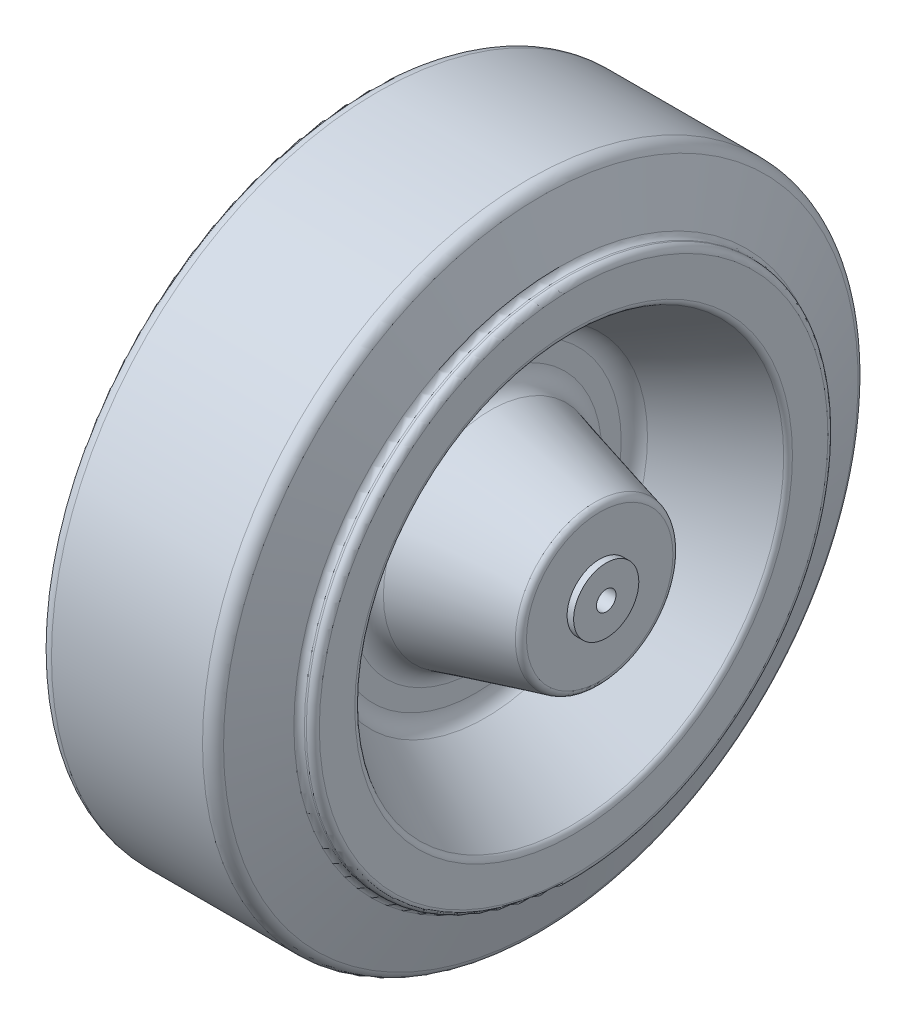
ISO-10303-21;
HEADER;
FILE_DESCRIPTION(('STEP AP214'),'2;1');
FILE_NAME('part.step','',(''),(''),'','','');
FILE_SCHEMA(('AUTOMOTIVE_DESIGN { 1 0 10303 214 1 1 1 1 }'));
ENDSEC;
DATA;
#1=APPLICATION_CONTEXT('core data for automotive mechanical design processes');
#2=APPLICATION_PROTOCOL_DEFINITION('international standard','automotive_design',2000,#1);
#3=PRODUCT_CONTEXT('',#1,'mechanical');
#4=PRODUCT('Part','Part','',(#3));
#5=PRODUCT_RELATED_PRODUCT_CATEGORY('part','',(#4));
#6=PRODUCT_DEFINITION_FORMATION('','',#4);
#7=PRODUCT_DEFINITION_CONTEXT('part definition',#1,'design');
#8=PRODUCT_DEFINITION('design','',#6,#7);
#9=PRODUCT_DEFINITION_SHAPE('','',#8);
#10=(LENGTH_UNIT() NAMED_UNIT(*) SI_UNIT(.MILLI.,.METRE.));
#11=(NAMED_UNIT(*) PLANE_ANGLE_UNIT() SI_UNIT($,.RADIAN.));
#12=(NAMED_UNIT(*) SI_UNIT($,.STERADIAN.) SOLID_ANGLE_UNIT());
#13=UNCERTAINTY_MEASURE_WITH_UNIT(LENGTH_MEASURE(1.E-05),#10,'distance_accuracy_value','');
#14=(GEOMETRIC_REPRESENTATION_CONTEXT(3) GLOBAL_UNCERTAINTY_ASSIGNED_CONTEXT((#13)) GLOBAL_UNIT_ASSIGNED_CONTEXT((#10,
#11,#12)) REPRESENTATION_CONTEXT('',''));
#15=CARTESIAN_POINT('',(0.,0.,0.));
#16=DIRECTION('',(0.,0.,1.));
#17=DIRECTION('',(1.,0.,0.));
#18=AXIS2_PLACEMENT_3D('',#15,#16,#17);
#19=CARTESIAN_POINT('',(-23.5,0.,0.));
#20=DIRECTION('',(1.,0.,0.));
#21=DIRECTION('',(0.,0.,-1.));
#22=AXIS2_PLACEMENT_3D('',#19,#20,#21);
#23=CYLINDRICAL_SURFACE('',#22,1.5);
#24=CARTESIAN_POINT('',(23.5,0.,0.));
#25=DIRECTION('',(1.,0.,0.));
#26=DIRECTION('',(0.,0.,-1.));
#27=AXIS2_PLACEMENT_3D('',#24,#25,#26);
#28=CIRCLE('',#27,1.5);
#29=CARTESIAN_POINT('',(23.5,0.,-1.5));
#30=VERTEX_POINT('',#29);
#31=EDGE_CURVE('E940',#30,#30,#28,.T.);
#32=ORIENTED_EDGE('',*,*,#31,.T.);
#33=EDGE_LOOP('',(#32));
#34=FACE_BOUND('',#33,.T.);
#35=CARTESIAN_POINT('',(-23.5,0.,0.));
#36=DIRECTION('',(1.,0.,0.));
#37=DIRECTION('',(0.,0.,-1.));
#38=AXIS2_PLACEMENT_3D('',#35,#36,#37);
#39=CIRCLE('',#38,1.5);
#40=CARTESIAN_POINT('',(-23.5,0.,-1.5));
#41=VERTEX_POINT('',#40);
#42=EDGE_CURVE('E943',#41,#41,#39,.T.);
#43=ORIENTED_EDGE('',*,*,#42,.F.);
#44=EDGE_LOOP('',(#43));
#45=FACE_BOUND('',#44,.T.);
#46=ADVANCED_FACE('F17',(#34,#45),#23,.F.);
#47=CARTESIAN_POINT('',(23.5,0.,0.));
#48=DIRECTION('',(-1.,0.,0.));
#49=DIRECTION('',(0.,0.,1.));
#50=AXIS2_PLACEMENT_3D('',#47,#48,#49);
#51=PLANE('',#50);
#52=CARTESIAN_POINT('',(23.5,0.,0.));
#53=DIRECTION('',(1.,0.,0.));
#54=DIRECTION('',(0.,0.,-1.));
#55=AXIS2_PLACEMENT_3D('',#52,#53,#54);
#56=CIRCLE('',#55,5.);
#57=CARTESIAN_POINT('',(23.5,0.,-5.));
#58=VERTEX_POINT('',#57);
#59=EDGE_CURVE('E945',#58,#58,#56,.F.);
#60=ORIENTED_EDGE('',*,*,#59,.F.);
#61=EDGE_LOOP('',(#60));
#62=FACE_BOUND('',#61,.T.);
#63=ORIENTED_EDGE('',*,*,#31,.F.);
#64=EDGE_LOOP('',(#63));
#65=FACE_BOUND('',#64,.T.);
#66=ADVANCED_FACE('F898',(#62,#65),#51,.F.);
#67=CARTESIAN_POINT('',(-23.5,0.,0.));
#68=DIRECTION('',(-1.,0.,0.));
#69=DIRECTION('',(0.,0.,1.));
#70=AXIS2_PLACEMENT_3D('',#67,#68,#69);
#71=PLANE('',#70);
#72=CARTESIAN_POINT('',(-23.5,0.,0.));
#73=DIRECTION('',(1.,0.,0.));
#74=DIRECTION('',(0.,0.,-1.));
#75=AXIS2_PLACEMENT_3D('',#72,#73,#74);
#76=CIRCLE('',#75,5.);
#77=CARTESIAN_POINT('',(-23.5,0.,-5.));
#78=VERTEX_POINT('',#77);
#79=EDGE_CURVE('E948',#78,#78,#76,.T.);
#80=ORIENTED_EDGE('',*,*,#79,.F.);
#81=EDGE_LOOP('',(#80));
#82=FACE_BOUND('',#81,.T.);
#83=ORIENTED_EDGE('',*,*,#42,.T.);
#84=EDGE_LOOP('',(#83));
#85=FACE_BOUND('',#84,.T.);
#86=ADVANCED_FACE('F889',(#82,#85),#71,.T.);
#87=CARTESIAN_POINT('',(-23.5,0.,0.));
#88=DIRECTION('',(1.,0.,0.));
#89=DIRECTION('',(0.,0.,-1.));
#90=AXIS2_PLACEMENT_3D('',#87,#88,#89);
#91=CYLINDRICAL_SURFACE('',#90,5.);
#92=ORIENTED_EDGE('',*,*,#59,.T.);
#93=EDGE_LOOP('',(#92));
#94=FACE_BOUND('',#93,.T.);
#95=CARTESIAN_POINT('',(22.5,0.,0.));
#96=DIRECTION('',(1.,0.,0.));
#97=DIRECTION('',(0.,0.,-1.));
#98=AXIS2_PLACEMENT_3D('',#95,#96,#97);
#99=CIRCLE('',#98,5.);
#100=CARTESIAN_POINT('',(22.5,0.,-5.));
#101=VERTEX_POINT('',#100);
#102=EDGE_CURVE('E952',#101,#101,#99,.T.);
#103=ORIENTED_EDGE('',*,*,#102,.T.);
#104=EDGE_LOOP('',(#103));
#105=FACE_BOUND('',#104,.T.);
#106=ADVANCED_FACE('F880',(#94,#105),#91,.T.);
#107=CARTESIAN_POINT('',(-23.5,0.,0.));
#108=DIRECTION('',(1.,0.,0.));
#109=DIRECTION('',(0.,0.,-1.));
#110=AXIS2_PLACEMENT_3D('',#107,#108,#109);
#111=CYLINDRICAL_SURFACE('',#110,5.);
#112=ORIENTED_EDGE('',*,*,#79,.T.);
#113=EDGE_LOOP('',(#112));
#114=FACE_BOUND('',#113,.T.);
#115=CARTESIAN_POINT('',(-22.5,0.,0.));
#116=DIRECTION('',(1.,0.,0.));
#117=DIRECTION('',(0.,0.,-1.));
#118=AXIS2_PLACEMENT_3D('',#115,#116,#117);
#119=CIRCLE('',#118,5.);
#120=CARTESIAN_POINT('',(-22.5,0.,-5.));
#121=VERTEX_POINT('',#120);
#122=EDGE_CURVE('E101',#121,#121,#119,.F.);
#123=ORIENTED_EDGE('',*,*,#122,.T.);
#124=EDGE_LOOP('',(#123));
#125=FACE_BOUND('',#124,.T.);
#126=ADVANCED_FACE('F873',(#114,#125),#111,.T.);
#127=CARTESIAN_POINT('',(22.5,0.,0.));
#128=DIRECTION('',(-1.,0.,0.));
#129=DIRECTION('',(0.,0.,1.));
#130=AXIS2_PLACEMENT_3D('',#127,#128,#129);
#131=PLANE('',#130);
#132=CARTESIAN_POINT('',(22.5,0.,0.));
#133=DIRECTION('',(-1.,0.,0.));
#134=DIRECTION('',(0.,0.,-1.));
#135=AXIS2_PLACEMENT_3D('',#132,#133,#134);
#136=CIRCLE('',#135,11.2291114366111);
#137=CARTESIAN_POINT('',(22.5,0.,-11.2291114366111));
#138=VERTEX_POINT('',#137);
#139=CARTESIAN_POINT('',(22.5,0.,11.2291114366111));
#140=VERTEX_POINT('',#139);
#141=EDGE_CURVE('E96',#138,#140,#136,.T.);
#142=ORIENTED_EDGE('',*,*,#141,.F.);
#143=CARTESIAN_POINT('',(22.5,0.,0.));
#144=DIRECTION('',(-1.,0.,0.));
#145=DIRECTION('',(0.,0.,1.));
#146=AXIS2_PLACEMENT_3D('',#143,#144,#145);
#147=CIRCLE('',#146,11.2291114366111);
#148=EDGE_CURVE('E93',#140,#138,#147,.T.);
#149=ORIENTED_EDGE('',*,*,#148,.F.);
#150=EDGE_LOOP('',(#142,#149));
#151=FACE_BOUND('',#150,.T.);
#152=ORIENTED_EDGE('',*,*,#102,.F.);
#153=EDGE_LOOP('',(#152));
#154=FACE_BOUND('',#153,.T.);
#155=ADVANCED_FACE('F98',(#151,#154),#131,.F.);
#156=CARTESIAN_POINT('',(-22.5,0.,0.));
#157=DIRECTION('',(1.,0.,0.));
#158=DIRECTION('',(0.,0.,-1.));
#159=AXIS2_PLACEMENT_3D('',#156,#157,#158);
#160=PLANE('',#159);
#161=CARTESIAN_POINT('',(-22.5,0.,0.));
#162=DIRECTION('',(1.,0.,0.));
#163=DIRECTION('',(0.,0.,1.));
#164=AXIS2_PLACEMENT_3D('',#161,#162,#163);
#165=CIRCLE('',#164,11.2291114366111);
#166=CARTESIAN_POINT('',(-22.5,0.,11.2291114366111));
#167=VERTEX_POINT('',#166);
#168=CARTESIAN_POINT('',(-22.5,0.,-11.2291114366111));
#169=VERTEX_POINT('',#168);
#170=EDGE_CURVE('E106',#167,#169,#165,.T.);
#171=ORIENTED_EDGE('',*,*,#170,.F.);
#172=CARTESIAN_POINT('',(-22.5,0.,0.));
#173=DIRECTION('',(1.,0.,0.));
#174=DIRECTION('',(0.,0.,-1.));
#175=AXIS2_PLACEMENT_3D('',#172,#173,#174);
#176=CIRCLE('',#175,11.2291114366111);
#177=EDGE_CURVE('E151',#169,#167,#176,.T.);
#178=ORIENTED_EDGE('',*,*,#177,.F.);
#179=EDGE_LOOP('',(#171,#178));
#180=FACE_BOUND('',#179,.T.);
#181=ORIENTED_EDGE('',*,*,#122,.F.);
#182=EDGE_LOOP('',(#181));
#183=FACE_BOUND('',#182,.T.);
#184=ADVANCED_FACE('F127',(#180,#183),#160,.F.);
#185=CARTESIAN_POINT('',(21.5,0.,0.));
#186=DIRECTION('',(-1.,0.,0.));
#187=DIRECTION('',(0.,0.,1.));
#188=AXIS2_PLACEMENT_3D('',#185,#186,#187);
#189=TOROIDAL_SURFACE('',#188,11.2291114366111,1.);
#190=CARTESIAN_POINT('',(21.7544932992796,0.,0.));
#191=DIRECTION('',(-1.,0.,0.));
#192=DIRECTION('',(0.,0.,1.));
#193=AXIS2_PLACEMENT_3D('',#190,#191,#192);
#194=CIRCLE('',#193,12.1961859738738);
#195=CARTESIAN_POINT('',(21.7544932992796,0.,12.1961859738738));
#196=VERTEX_POINT('',#195);
#197=EDGE_CURVE('E137',#196,#196,#194,.T.);
#198=ORIENTED_EDGE('',*,*,#197,.F.);
#199=EDGE_LOOP('',(#198));
#200=FACE_BOUND('',#199,.T.);
#201=ORIENTED_EDGE('',*,*,#148,.T.);
#202=ORIENTED_EDGE('',*,*,#141,.T.);
#203=EDGE_LOOP('',(#201,#202));
#204=FACE_BOUND('',#203,.T.);
#205=ADVANCED_FACE('F105',(#200,#204),#189,.T.);
#206=CARTESIAN_POINT('',(-21.5,0.,0.));
#207=DIRECTION('',(-1.,0.,0.));
#208=DIRECTION('',(0.,0.,1.));
#209=AXIS2_PLACEMENT_3D('',#206,#207,#208);
#210=TOROIDAL_SURFACE('',#209,11.2291114366111,1.);
#211=ORIENTED_EDGE('',*,*,#170,.T.);
#212=ORIENTED_EDGE('',*,*,#177,.T.);
#213=EDGE_LOOP('',(#211,#212));
#214=FACE_BOUND('',#213,.T.);
#215=CARTESIAN_POINT('',(-21.7544932992796,0.,0.));
#216=DIRECTION('',(1.,0.,0.));
#217=DIRECTION('',(0.,0.,-1.));
#218=AXIS2_PLACEMENT_3D('',#215,#216,#217);
#219=CIRCLE('',#218,12.1961859738738);
#220=CARTESIAN_POINT('',(-21.7544932992796,0.,-12.1961859738738));
#221=VERTEX_POINT('',#220);
#222=EDGE_CURVE('E171',#221,#221,#219,.T.);
#223=ORIENTED_EDGE('',*,*,#222,.F.);
#224=EDGE_LOOP('',(#223));
#225=FACE_BOUND('',#224,.T.);
#226=ADVANCED_FACE('F126',(#214,#225),#210,.T.);
#227=CARTESIAN_POINT('',(5.73652010216107,0.,0.));
#228=DIRECTION('',(-1.,0.,0.));
#229=DIRECTION('',(0.,0.,1.));
#230=AXIS2_PLACEMENT_3D('',#227,#228,#229);
#231=CONICAL_SURFACE('',#230,16.4114420783787,0.257323714971089);
#232=CARTESIAN_POINT('',(5.73652010216108,0.,0.));
#233=DIRECTION('',(-1.,0.,0.));
#234=DIRECTION('',(0.,0.,1.));
#235=AXIS2_PLACEMENT_3D('',#232,#233,#234);
#236=CIRCLE('',#235,16.4114420783787);
#237=CARTESIAN_POINT('',(5.73652010216108,0.,16.4114420783787));
#238=VERTEX_POINT('',#237);
#239=EDGE_CURVE('E175',#238,#238,#236,.F.);
#240=ORIENTED_EDGE('',*,*,#239,.T.);
#241=EDGE_LOOP('',(#240));
#242=FACE_BOUND('',#241,.T.);
#243=ORIENTED_EDGE('',*,*,#197,.T.);
#244=EDGE_LOOP('',(#243));
#245=FACE_BOUND('',#244,.T.);
#246=ADVANCED_FACE('F841',(#242,#245),#231,.T.);
#247=CARTESIAN_POINT('',(-5.73652010216108,0.,0.));
#248=DIRECTION('',(1.,0.,0.));
#249=DIRECTION('',(0.,0.,-1.));
#250=AXIS2_PLACEMENT_3D('',#247,#248,#249);
#251=CONICAL_SURFACE('',#250,16.4114420783787,0.257323714971088);
#252=CARTESIAN_POINT('',(-5.73652010216108,0.,0.));
#253=DIRECTION('',(-1.,0.,0.));
#254=DIRECTION('',(0.,0.,1.));
#255=AXIS2_PLACEMENT_3D('',#252,#253,#254);
#256=CIRCLE('',#255,16.4114420783787);
#257=CARTESIAN_POINT('',(-5.73652010216108,0.,16.4114420783787));
#258=VERTEX_POINT('',#257);
#259=EDGE_CURVE('E180',#258,#258,#256,.T.);
#260=ORIENTED_EDGE('',*,*,#259,.T.);
#261=EDGE_LOOP('',(#260));
#262=FACE_BOUND('',#261,.T.);
#263=ORIENTED_EDGE('',*,*,#222,.T.);
#264=EDGE_LOOP('',(#263));
#265=FACE_BOUND('',#264,.T.);
#266=ADVANCED_FACE('F203',(#262,#265),#251,.T.);
#267=CARTESIAN_POINT('',(6.5,0.,0.));
#268=DIRECTION('',(-1.,0.,0.));
#269=DIRECTION('',(0.,0.,1.));
#270=AXIS2_PLACEMENT_3D('',#267,#268,#269);
#271=TOROIDAL_SURFACE('',#270,19.3126656901666,3.);
#272=CARTESIAN_POINT('',(3.5,0.,0.));
#273=DIRECTION('',(1.,0.,0.));
#274=DIRECTION('',(0.,0.,-1.));
#275=AXIS2_PLACEMENT_3D('',#272,#273,#274);
#276=CIRCLE('',#275,19.3126656901666);
#277=CARTESIAN_POINT('',(3.5,0.,-19.3126656901666));
#278=VERTEX_POINT('',#277);
#279=CARTESIAN_POINT('',(3.5,0.,19.3126656901666));
#280=VERTEX_POINT('',#279);
#281=EDGE_CURVE('E341',#278,#280,#276,.T.);
#282=ORIENTED_EDGE('',*,*,#281,.T.);
#283=CARTESIAN_POINT('',(3.5,0.,0.));
#284=DIRECTION('',(1.,0.,0.));
#285=DIRECTION('',(0.,0.,1.));
#286=AXIS2_PLACEMENT_3D('',#283,#284,#285);
#287=CIRCLE('',#286,19.3126656901666);
#288=EDGE_CURVE('E186',#280,#278,#287,.T.);
#289=ORIENTED_EDGE('',*,*,#288,.T.);
#290=EDGE_LOOP('',(#282,#289));
#291=FACE_BOUND('',#290,.T.);
#292=ORIENTED_EDGE('',*,*,#239,.F.);
#293=EDGE_LOOP('',(#292));
#294=FACE_BOUND('',#293,.T.);
#295=ADVANCED_FACE('F192',(#291,#294),#271,.F.);
#296=CARTESIAN_POINT('',(-6.5,0.,0.));
#297=DIRECTION('',(-1.,0.,0.));
#298=DIRECTION('',(0.,0.,1.));
#299=AXIS2_PLACEMENT_3D('',#296,#297,#298);
#300=TOROIDAL_SURFACE('',#299,19.3126656901666,3.);
#301=ORIENTED_EDGE('',*,*,#259,.F.);
#302=EDGE_LOOP('',(#301));
#303=FACE_BOUND('',#302,.T.);
#304=CARTESIAN_POINT('',(-3.5,0.,0.));
#305=DIRECTION('',(-1.,0.,0.));
#306=DIRECTION('',(0.,0.,-1.));
#307=AXIS2_PLACEMENT_3D('',#304,#305,#306);
#308=CIRCLE('',#307,19.3126656901666);
#309=CARTESIAN_POINT('',(-3.5,0.,-19.3126656901666));
#310=VERTEX_POINT('',#309);
#311=CARTESIAN_POINT('',(-3.5,0.,19.3126656901666));
#312=VERTEX_POINT('',#311);
#313=EDGE_CURVE('E256',#310,#312,#308,.T.);
#314=ORIENTED_EDGE('',*,*,#313,.T.);
#315=CARTESIAN_POINT('',(-3.5,0.,0.));
#316=DIRECTION('',(-1.,0.,0.));
#317=DIRECTION('',(0.,0.,1.));
#318=AXIS2_PLACEMENT_3D('',#315,#316,#317);
#319=CIRCLE('',#318,19.3126656901666);
#320=EDGE_CURVE('E221',#312,#310,#319,.T.);
#321=ORIENTED_EDGE('',*,*,#320,.T.);
#322=EDGE_LOOP('',(#314,#321));
#323=FACE_BOUND('',#322,.T.);
#324=ADVANCED_FACE('F202',(#303,#323),#300,.F.);
#325=CARTESIAN_POINT('',(3.5,19.3126656901666,0.));
#326=DIRECTION('',(-1.,0.,0.));
#327=DIRECTION('',(0.,0.,1.));
#328=AXIS2_PLACEMENT_3D('',#325,#326,#327);
#329=PLANE('',#328);
#330=ORIENTED_EDGE('',*,*,#288,.F.);
#331=ORIENTED_EDGE('',*,*,#281,.F.);
#332=EDGE_LOOP('',(#330,#331));
#333=FACE_BOUND('',#332,.T.);
#334=CARTESIAN_POINT('',(3.5,0.,0.));
#335=DIRECTION('',(-1.,0.,0.));
#336=DIRECTION('',(0.,0.,-1.));
#337=AXIS2_PLACEMENT_3D('',#334,#335,#336);
#338=CIRCLE('',#337,22.3014288630928);
#339=CARTESIAN_POINT('',(3.5,0.,22.3014288630928));
#340=VERTEX_POINT('',#339);
#341=CARTESIAN_POINT('',(3.5,0.,-22.3014288630928));
#342=VERTEX_POINT('',#341);
#343=EDGE_CURVE('E310',#340,#342,#338,.F.);
#344=ORIENTED_EDGE('',*,*,#343,.T.);
#345=CARTESIAN_POINT('',(3.5,0.,0.));
#346=DIRECTION('',(-1.,0.,0.));
#347=DIRECTION('',(0.,0.,1.));
#348=AXIS2_PLACEMENT_3D('',#345,#346,#347);
#349=CIRCLE('',#348,22.3014288630928);
#350=EDGE_CURVE('E451',#342,#340,#349,.F.);
#351=ORIENTED_EDGE('',*,*,#350,.T.);
#352=EDGE_LOOP('',(#344,#351));
#353=FACE_BOUND('',#352,.T.);
#354=ADVANCED_FACE('F315',(#333,#353),#329,.F.);
#355=CARTESIAN_POINT('',(-3.5,19.3126656901666,0.));
#356=DIRECTION('',(1.,0.,0.));
#357=DIRECTION('',(0.,0.,-1.));
#358=AXIS2_PLACEMENT_3D('',#355,#356,#357);
#359=PLANE('',#358);
#360=CARTESIAN_POINT('',(-3.49999999999999,0.,0.));
#361=DIRECTION('',(1.,0.,0.));
#362=DIRECTION('',(0.,0.,1.));
#363=AXIS2_PLACEMENT_3D('',#360,#361,#362);
#364=CIRCLE('',#363,22.3014288630928);
#365=CARTESIAN_POINT('',(-3.49999999999999,0.,-22.3014288630928));
#366=VERTEX_POINT('',#365);
#367=CARTESIAN_POINT('',(-3.49999999999999,0.,22.3014288630928));
#368=VERTEX_POINT('',#367);
#369=EDGE_CURVE('E277',#366,#368,#364,.F.);
#370=ORIENTED_EDGE('',*,*,#369,.T.);
#371=CARTESIAN_POINT('',(-3.49999999999999,0.,0.));
#372=DIRECTION('',(1.,0.,0.));
#373=DIRECTION('',(0.,0.,-1.));
#374=AXIS2_PLACEMENT_3D('',#371,#372,#373);
#375=CIRCLE('',#374,22.3014288630928);
#376=EDGE_CURVE('E288',#368,#366,#375,.F.);
#377=ORIENTED_EDGE('',*,*,#376,.T.);
#378=EDGE_LOOP('',(#370,#377));
#379=FACE_BOUND('',#378,.T.);
#380=ORIENTED_EDGE('',*,*,#313,.F.);
#381=ORIENTED_EDGE('',*,*,#320,.F.);
#382=EDGE_LOOP('',(#380,#381));
#383=FACE_BOUND('',#382,.T.);
#384=ADVANCED_FACE('F243',(#379,#383),#359,.F.);
#385=CARTESIAN_POINT('',(6.5,0.,0.));
#386=DIRECTION('',(-1.,0.,0.));
#387=DIRECTION('',(0.,0.,1.));
#388=AXIS2_PLACEMENT_3D('',#385,#386,#387);
#389=TOROIDAL_SURFACE('',#388,22.3014288630928,3.);
#390=CARTESIAN_POINT('',(4.95651273371741,0.,0.));
#391=DIRECTION('',(1.,0.,0.));
#392=DIRECTION('',(0.,0.,-1.));
#393=AXIS2_PLACEMENT_3D('',#390,#391,#392);
#394=CIRCLE('',#393,24.8739076402305);
#395=CARTESIAN_POINT('',(4.95651273371741,0.,-24.8739076402305));
#396=VERTEX_POINT('',#395);
#397=EDGE_CURVE('E253',#396,#396,#394,.T.);
#398=ORIENTED_EDGE('',*,*,#397,.T.);
#399=EDGE_LOOP('',(#398));
#400=FACE_BOUND('',#399,.T.);
#401=ORIENTED_EDGE('',*,*,#343,.F.);
#402=ORIENTED_EDGE('',*,*,#350,.F.);
#403=EDGE_LOOP('',(#401,#402));
#404=FACE_BOUND('',#403,.T.);
#405=ADVANCED_FACE('F231',(#400,#404),#389,.F.);
#406=CARTESIAN_POINT('',(-6.49999999999999,0.,0.));
#407=DIRECTION('',(-1.,0.,0.));
#408=DIRECTION('',(0.,0.,1.));
#409=AXIS2_PLACEMENT_3D('',#406,#407,#408);
#410=TOROIDAL_SURFACE('',#409,22.3014288630928,3.);
#411=ORIENTED_EDGE('',*,*,#376,.F.);
#412=ORIENTED_EDGE('',*,*,#369,.F.);
#413=EDGE_LOOP('',(#411,#412));
#414=FACE_BOUND('',#413,.T.);
#415=CARTESIAN_POINT('',(-4.95651273371741,0.,0.));
#416=DIRECTION('',(-1.,0.,0.));
#417=DIRECTION('',(0.,0.,1.));
#418=AXIS2_PLACEMENT_3D('',#415,#416,#417);
#419=CIRCLE('',#418,24.8739076402305);
#420=CARTESIAN_POINT('',(-4.95651273371741,0.,24.8739076402305));
#421=VERTEX_POINT('',#420);
#422=EDGE_CURVE('E444',#421,#421,#419,.T.);
#423=ORIENTED_EDGE('',*,*,#422,.T.);
#424=EDGE_LOOP('',(#423));
#425=FACE_BOUND('',#424,.T.);
#426=ADVANCED_FACE('F242',(#414,#425),#410,.F.);
#427=CARTESIAN_POINT('',(18.0144957554275,0.,0.));
#428=DIRECTION('',(1.,0.,0.));
#429=DIRECTION('',(0.,0.,-1.));
#430=AXIS2_PLACEMENT_3D('',#427,#428,#429);
#431=CONICAL_SURFACE('',#430,32.7086974532565,0.540419500270584);
#432=ORIENTED_EDGE('',*,*,#397,.F.);
#433=EDGE_LOOP('',(#432));
#434=FACE_BOUND('',#433,.T.);
#435=CARTESIAN_POINT('',(18.0144957554275,0.,0.));
#436=DIRECTION('',(-1.,0.,0.));
#437=DIRECTION('',(0.,0.,1.));
#438=AXIS2_PLACEMENT_3D('',#435,#436,#437);
#439=CIRCLE('',#438,32.7086974532565);
#440=CARTESIAN_POINT('',(18.0144957554275,0.,32.7086974532565));
#441=VERTEX_POINT('',#440);
#442=EDGE_CURVE('E441',#441,#441,#439,.T.);
#443=ORIENTED_EDGE('',*,*,#442,.F.);
#444=EDGE_LOOP('',(#443));
#445=FACE_BOUND('',#444,.T.);
#446=ADVANCED_FACE('F453',(#434,#445),#431,.F.);
#447=CARTESIAN_POINT('',(-18.0144957554275,0.,0.));
#448=DIRECTION('',(-1.,0.,0.));
#449=DIRECTION('',(0.,0.,1.));
#450=AXIS2_PLACEMENT_3D('',#447,#448,#449);
#451=CONICAL_SURFACE('',#450,32.7086974532565,0.540419500270583);
#452=ORIENTED_EDGE('',*,*,#422,.F.);
#453=EDGE_LOOP('',(#452));
#454=FACE_BOUND('',#453,.T.);
#455=CARTESIAN_POINT('',(-18.0144957554275,0.,0.));
#456=DIRECTION('',(-1.,0.,0.));
#457=DIRECTION('',(0.,0.,1.));
#458=AXIS2_PLACEMENT_3D('',#455,#456,#457);
#459=CIRCLE('',#458,32.7086974532565);
#460=CARTESIAN_POINT('',(-18.0144957554275,0.,32.7086974532565));
#461=VERTEX_POINT('',#460);
#462=EDGE_CURVE('E432',#461,#461,#459,.F.);
#463=ORIENTED_EDGE('',*,*,#462,.F.);
#464=EDGE_LOOP('',(#463));
#465=FACE_BOUND('',#464,.T.);
#466=ADVANCED_FACE('F413',(#454,#465),#451,.F.);
#467=CARTESIAN_POINT('',(17.5,0.,0.));
#468=DIRECTION('',(-1.,0.,0.));
#469=DIRECTION('',(0.,0.,1.));
#470=AXIS2_PLACEMENT_3D('',#467,#468,#469);
#471=TOROIDAL_SURFACE('',#470,33.5661903789691,1.);
#472=CARTESIAN_POINT('',(18.5,0.,0.));
#473=DIRECTION('',(1.,0.,0.));
#474=DIRECTION('',(0.,0.,1.));
#475=AXIS2_PLACEMENT_3D('',#472,#473,#474);
#476=CIRCLE('',#475,33.5661903789691);
#477=CARTESIAN_POINT('',(18.5,0.,33.5661903789691));
#478=VERTEX_POINT('',#477);
#479=CARTESIAN_POINT('',(18.5,0.,-33.5661903789691));
#480=VERTEX_POINT('',#479);
#481=EDGE_CURVE('E440',#478,#480,#476,.T.);
#482=ORIENTED_EDGE('',*,*,#481,.T.);
#483=CARTESIAN_POINT('',(18.5,0.,0.));
#484=DIRECTION('',(1.,0.,0.));
#485=DIRECTION('',(0.,0.,-1.));
#486=AXIS2_PLACEMENT_3D('',#483,#484,#485);
#487=CIRCLE('',#486,33.5661903789691);
#488=EDGE_CURVE('E427',#480,#478,#487,.T.);
#489=ORIENTED_EDGE('',*,*,#488,.T.);
#490=EDGE_LOOP('',(#482,#489));
#491=FACE_BOUND('',#490,.T.);
#492=ORIENTED_EDGE('',*,*,#442,.T.);
#493=EDGE_LOOP('',(#492));
#494=FACE_BOUND('',#493,.T.);
#495=ADVANCED_FACE('F401',(#491,#494),#471,.T.);
#496=CARTESIAN_POINT('',(-17.5,0.,0.));
#497=DIRECTION('',(-1.,0.,0.));
#498=DIRECTION('',(0.,0.,1.));
#499=AXIS2_PLACEMENT_3D('',#496,#497,#498);
#500=TOROIDAL_SURFACE('',#499,33.5661903789691,1.);
#501=ORIENTED_EDGE('',*,*,#462,.T.);
#502=EDGE_LOOP('',(#501));
#503=FACE_BOUND('',#502,.T.);
#504=CARTESIAN_POINT('',(-18.5,0.,0.));
#505=DIRECTION('',(-1.,0.,0.));
#506=DIRECTION('',(0.,0.,1.));
#507=AXIS2_PLACEMENT_3D('',#504,#505,#506);
#508=CIRCLE('',#507,33.5661903789691);
#509=CARTESIAN_POINT('',(-18.5,0.,33.5661903789691));
#510=VERTEX_POINT('',#509);
#511=CARTESIAN_POINT('',(-18.5,0.,-33.5661903789691));
#512=VERTEX_POINT('',#511);
#513=EDGE_CURVE('E578',#510,#512,#508,.T.);
#514=ORIENTED_EDGE('',*,*,#513,.T.);
#515=CARTESIAN_POINT('',(-18.5,0.,0.));
#516=DIRECTION('',(-1.,0.,0.));
#517=DIRECTION('',(0.,0.,-1.));
#518=AXIS2_PLACEMENT_3D('',#515,#516,#517);
#519=CIRCLE('',#518,33.5661903789691);
#520=EDGE_CURVE('E569',#512,#510,#519,.T.);
#521=ORIENTED_EDGE('',*,*,#520,.T.);
#522=EDGE_LOOP('',(#514,#521));
#523=FACE_BOUND('',#522,.T.);
#524=ADVANCED_FACE('F412',(#503,#523),#500,.T.);
#525=CARTESIAN_POINT('',(18.5,33.5661903789691,0.));
#526=DIRECTION('',(-1.,0.,0.));
#527=DIRECTION('',(0.,0.,1.));
#528=AXIS2_PLACEMENT_3D('',#525,#526,#527);
#529=PLANE('',#528);
#530=ORIENTED_EDGE('',*,*,#481,.F.);
#531=ORIENTED_EDGE('',*,*,#488,.F.);
#532=EDGE_LOOP('',(#530,#531));
#533=FACE_BOUND('',#532,.T.);
#534=CARTESIAN_POINT('',(18.5,0.,0.));
#535=DIRECTION('',(-1.,0.,0.));
#536=DIRECTION('',(0.,0.,-1.));
#537=AXIS2_PLACEMENT_3D('',#534,#535,#536);
#538=CIRCLE('',#537,39.);
#539=CARTESIAN_POINT('',(18.5,0.,-39.));
#540=VERTEX_POINT('',#539);
#541=CARTESIAN_POINT('',(18.5,0.,39.));
#542=VERTEX_POINT('',#541);
#543=EDGE_CURVE('E558',#540,#542,#538,.T.);
#544=ORIENTED_EDGE('',*,*,#543,.F.);
#545=CARTESIAN_POINT('',(18.5,0.,0.));
#546=DIRECTION('',(-1.,0.,0.));
#547=DIRECTION('',(0.,0.,1.));
#548=AXIS2_PLACEMENT_3D('',#545,#546,#547);
#549=CIRCLE('',#548,39.);
#550=EDGE_CURVE('E618',#542,#540,#549,.T.);
#551=ORIENTED_EDGE('',*,*,#550,.F.);
#552=EDGE_LOOP('',(#544,#551));
#553=FACE_BOUND('',#552,.T.);
#554=ADVANCED_FACE('F596',(#533,#553),#529,.F.);
#555=CARTESIAN_POINT('',(-18.5,33.5661903789691,0.));
#556=DIRECTION('',(1.,0.,0.));
#557=DIRECTION('',(0.,0.,-1.));
#558=AXIS2_PLACEMENT_3D('',#555,#556,#557);
#559=PLANE('',#558);
#560=CARTESIAN_POINT('',(-18.5,0.,0.));
#561=DIRECTION('',(1.,0.,0.));
#562=DIRECTION('',(0.,0.,1.));
#563=AXIS2_PLACEMENT_3D('',#560,#561,#562);
#564=CIRCLE('',#563,39.);
#565=CARTESIAN_POINT('',(-18.5,0.,39.));
#566=VERTEX_POINT('',#565);
#567=CARTESIAN_POINT('',(-18.5,0.,-39.));
#568=VERTEX_POINT('',#567);
#569=EDGE_CURVE('E36',#566,#568,#564,.T.);
#570=ORIENTED_EDGE('',*,*,#569,.F.);
#571=CARTESIAN_POINT('',(-18.5,0.,0.));
#572=DIRECTION('',(1.,0.,0.));
#573=DIRECTION('',(0.,0.,-1.));
#574=AXIS2_PLACEMENT_3D('',#571,#572,#573);
#575=CIRCLE('',#574,39.);
#576=EDGE_CURVE('E522',#568,#566,#575,.T.);
#577=ORIENTED_EDGE('',*,*,#576,.F.);
#578=EDGE_LOOP('',(#570,#577));
#579=FACE_BOUND('',#578,.T.);
#580=ORIENTED_EDGE('',*,*,#520,.F.);
#581=ORIENTED_EDGE('',*,*,#513,.F.);
#582=EDGE_LOOP('',(#580,#581));
#583=FACE_BOUND('',#582,.T.);
#584=ADVANCED_FACE('F581',(#579,#583),#559,.F.);
#585=CARTESIAN_POINT('',(17.5,0.,0.));
#586=DIRECTION('',(-1.,0.,0.));
#587=DIRECTION('',(0.,0.,1.));
#588=AXIS2_PLACEMENT_3D('',#585,#586,#587);
#589=TOROIDAL_SURFACE('',#588,39.,1.);
#590=CARTESIAN_POINT('',(17.5,0.,0.));
#591=DIRECTION('',(-1.,0.,0.));
#592=DIRECTION('',(0.,0.,1.));
#593=AXIS2_PLACEMENT_3D('',#590,#591,#592);
#594=CIRCLE('',#593,40.);
#595=CARTESIAN_POINT('',(17.5,0.,40.));
#596=VERTEX_POINT('',#595);
#597=EDGE_CURVE('E519',#596,#596,#594,.T.);
#598=ORIENTED_EDGE('',*,*,#597,.F.);
#599=EDGE_LOOP('',(#598));
#600=FACE_BOUND('',#599,.T.);
#601=ORIENTED_EDGE('',*,*,#550,.T.);
#602=ORIENTED_EDGE('',*,*,#543,.T.);
#603=EDGE_LOOP('',(#601,#602));
#604=FACE_BOUND('',#603,.T.);
#605=ADVANCED_FACE('F533',(#600,#604),#589,.T.);
#606=CARTESIAN_POINT('',(-17.5,0.,0.));
#607=DIRECTION('',(-1.,0.,0.));
#608=DIRECTION('',(0.,0.,1.));
#609=AXIS2_PLACEMENT_3D('',#606,#607,#608);
#610=TOROIDAL_SURFACE('',#609,39.,1.);
#611=ORIENTED_EDGE('',*,*,#569,.T.);
#612=ORIENTED_EDGE('',*,*,#576,.T.);
#613=EDGE_LOOP('',(#611,#612));
#614=FACE_BOUND('',#613,.T.);
#615=CARTESIAN_POINT('',(-17.5,0.,0.));
#616=DIRECTION('',(-1.,0.,0.));
#617=DIRECTION('',(0.,0.,1.));
#618=AXIS2_PLACEMENT_3D('',#615,#616,#617);
#619=CIRCLE('',#618,40.);
#620=CARTESIAN_POINT('',(-17.5,0.,40.));
#621=VERTEX_POINT('',#620);
#622=EDGE_CURVE('E518',#621,#621,#619,.F.);
#623=ORIENTED_EDGE('',*,*,#622,.F.);
#624=EDGE_LOOP('',(#623));
#625=FACE_BOUND('',#624,.T.);
#626=ADVANCED_FACE('F528',(#614,#625),#610,.T.);
#627=CARTESIAN_POINT('',(-22.5,0.,0.));
#628=DIRECTION('',(-1.,0.,0.));
#629=DIRECTION('',(0.,0.,1.));
#630=AXIS2_PLACEMENT_3D('',#627,#628,#629);
#631=CYLINDRICAL_SURFACE('',#630,40.);
#632=CARTESIAN_POINT('',(17.2094810050209,0.,0.));
#633=DIRECTION('',(-1.,0.,0.));
#634=DIRECTION('',(0.,0.,1.));
#635=AXIS2_PLACEMENT_3D('',#632,#633,#634);
#636=CIRCLE('',#635,40.);
#637=CARTESIAN_POINT('',(17.2094810050209,0.,40.));
#638=VERTEX_POINT('',#637);
#639=EDGE_CURVE('E515',#638,#638,#636,.F.);
#640=ORIENTED_EDGE('',*,*,#639,.T.);
#641=EDGE_LOOP('',(#640));
#642=FACE_BOUND('',#641,.T.);
#643=ORIENTED_EDGE('',*,*,#597,.T.);
#644=EDGE_LOOP('',(#643));
#645=FACE_BOUND('',#644,.T.);
#646=ADVANCED_FACE('F532',(#642,#645),#631,.T.);
#647=CARTESIAN_POINT('',(-22.5,0.,0.));
#648=DIRECTION('',(-1.,0.,0.));
#649=DIRECTION('',(0.,0.,1.));
#650=AXIS2_PLACEMENT_3D('',#647,#648,#649);
#651=CYLINDRICAL_SURFACE('',#650,40.);
#652=ORIENTED_EDGE('',*,*,#622,.T.);
#653=EDGE_LOOP('',(#652));
#654=FACE_BOUND('',#653,.T.);
#655=CARTESIAN_POINT('',(-17.2094810050209,0.,0.));
#656=DIRECTION('',(-1.,0.,0.));
#657=DIRECTION('',(0.,0.,1.));
#658=AXIS2_PLACEMENT_3D('',#655,#656,#657);
#659=CIRCLE('',#658,40.);
#660=CARTESIAN_POINT('',(-17.2094810050209,0.,40.));
#661=VERTEX_POINT('',#660);
#662=EDGE_CURVE('E496',#661,#661,#659,.T.);
#663=ORIENTED_EDGE('',*,*,#662,.T.);
#664=EDGE_LOOP('',(#663));
#665=FACE_BOUND('',#664,.T.);
#666=ADVANCED_FACE('F510',(#654,#665),#651,.T.);
#667=CARTESIAN_POINT('',(17.2094810050209,0.,0.));
#668=DIRECTION('',(-1.,0.,0.));
#669=DIRECTION('',(0.,0.,1.));
#670=AXIS2_PLACEMENT_3D('',#667,#668,#669);
#671=TOROIDAL_SURFACE('',#670,41.,1.);
#672=CARTESIAN_POINT('',(16.2656226486548,0.,0.));
#673=DIRECTION('',(-1.,0.,0.));
#674=DIRECTION('',(0.,0.,1.));
#675=AXIS2_PLACEMENT_3D('',#672,#673,#674);
#676=CIRCLE('',#675,40.6696495752719);
#677=CARTESIAN_POINT('',(16.2656226486548,0.,40.6696495752719));
#678=VERTEX_POINT('',#677);
#679=EDGE_CURVE('E493',#678,#678,#676,.T.);
#680=ORIENTED_EDGE('',*,*,#679,.F.);
#681=EDGE_LOOP('',(#680));
#682=FACE_BOUND('',#681,.T.);
#683=ORIENTED_EDGE('',*,*,#639,.F.);
#684=EDGE_LOOP('',(#683));
#685=FACE_BOUND('',#684,.T.);
#686=ADVANCED_FACE('F506',(#682,#685),#671,.F.);
#687=CARTESIAN_POINT('',(-17.2094810050209,0.,0.));
#688=DIRECTION('',(-1.,0.,0.));
#689=DIRECTION('',(0.,0.,1.));
#690=AXIS2_PLACEMENT_3D('',#687,#688,#689);
#691=TOROIDAL_SURFACE('',#690,41.,1.);
#692=ORIENTED_EDGE('',*,*,#662,.F.);
#693=EDGE_LOOP('',(#692));
#694=FACE_BOUND('',#693,.T.);
#695=CARTESIAN_POINT('',(-16.2656226486548,0.,0.));
#696=DIRECTION('',(1.,0.,0.));
#697=DIRECTION('',(0.,0.,-1.));
#698=AXIS2_PLACEMENT_3D('',#695,#696,#697);
#699=CIRCLE('',#698,40.6696495752719);
#700=CARTESIAN_POINT('',(-16.2656226486548,0.,-40.6696495752719));
#701=VERTEX_POINT('',#700);
#702=EDGE_CURVE('E490',#701,#701,#699,.T.);
#703=ORIENTED_EDGE('',*,*,#702,.F.);
#704=EDGE_LOOP('',(#703));
#705=FACE_BOUND('',#704,.T.);
#706=ADVANCED_FACE('F501',(#694,#705),#691,.F.);
#707=CARTESIAN_POINT('',(13.4687547026903,0.,0.));
#708=DIRECTION('',(-1.,0.,0.));
#709=DIRECTION('',(0.,-1.,0.));
#710=AXIS2_PLACEMENT_3D('',#707,#708,#709);
#711=CONICAL_SURFACE('',#710,48.6607008494562,1.23412150740817);
#712=CARTESIAN_POINT('',(13.4687547026903,0.,0.));
#713=DIRECTION('',(-1.,0.,0.));
#714=DIRECTION('',(0.,0.,1.));
#715=AXIS2_PLACEMENT_3D('',#712,#713,#714);
#716=CIRCLE('',#715,48.6607008494562);
#717=CARTESIAN_POINT('',(13.4687547026903,0.,48.6607008494562));
#718=VERTEX_POINT('',#717);
#719=EDGE_CURVE('E485',#718,#718,#716,.T.);
#720=ORIENTED_EDGE('',*,*,#719,.F.);
#721=EDGE_LOOP('',(#720));
#722=FACE_BOUND('',#721,.T.);
#723=ORIENTED_EDGE('',*,*,#679,.T.);
#724=EDGE_LOOP('',(#723));
#725=FACE_BOUND('',#724,.T.);
#726=ADVANCED_FACE('F505',(#722,#725),#711,.T.);
#727=CARTESIAN_POINT('',(-13.4687547026903,0.,0.));
#728=DIRECTION('',(1.,0.,0.));
#729=DIRECTION('',(0.,1.,0.));
#730=AXIS2_PLACEMENT_3D('',#727,#728,#729);
#731=CONICAL_SURFACE('',#730,48.6607008494562,1.23412150740817);
#732=CARTESIAN_POINT('',(-13.4687547026903,0.,0.));
#733=DIRECTION('',(-1.,0.,0.));
#734=DIRECTION('',(0.,0.,1.));
#735=AXIS2_PLACEMENT_3D('',#732,#733,#734);
#736=CIRCLE('',#735,48.6607008494562);
#737=CARTESIAN_POINT('',(-13.4687547026903,0.,48.6607008494562));
#738=VERTEX_POINT('',#737);
#739=EDGE_CURVE('E483',#738,#738,#736,.F.);
#740=ORIENTED_EDGE('',*,*,#739,.F.);
#741=EDGE_LOOP('',(#740));
#742=FACE_BOUND('',#741,.T.);
#743=ORIENTED_EDGE('',*,*,#702,.T.);
#744=EDGE_LOOP('',(#743));
#745=FACE_BOUND('',#744,.T.);
#746=ADVANCED_FACE('F677',(#742,#745),#731,.T.);
#747=CARTESIAN_POINT('',(11.5810379899583,0.,0.));
#748=DIRECTION('',(-1.,0.,0.));
#749=DIRECTION('',(0.,0.,1.));
#750=AXIS2_PLACEMENT_3D('',#747,#748,#749);
#751=TOROIDAL_SURFACE('',#750,48.,2.);
#752=CARTESIAN_POINT('',(11.5810379899583,0.,0.));
#753=DIRECTION('',(-1.,0.,0.));
#754=DIRECTION('',(0.,0.,1.));
#755=AXIS2_PLACEMENT_3D('',#752,#753,#754);
#756=CIRCLE('',#755,50.);
#757=CARTESIAN_POINT('',(11.5810379899583,0.,50.));
#758=VERTEX_POINT('',#757);
#759=EDGE_CURVE('E28',#758,#758,#756,.T.);
#760=ORIENTED_EDGE('',*,*,#759,.F.);
#761=EDGE_LOOP('',(#760));
#762=FACE_BOUND('',#761,.T.);
#763=ORIENTED_EDGE('',*,*,#719,.T.);
#764=EDGE_LOOP('',(#763));
#765=FACE_BOUND('',#764,.T.);
#766=ADVANCED_FACE('F472',(#762,#765),#751,.T.);
#767=CARTESIAN_POINT('',(-11.5810379899583,0.,0.));
#768=DIRECTION('',(-1.,0.,0.));
#769=DIRECTION('',(0.,0.,1.));
#770=AXIS2_PLACEMENT_3D('',#767,#768,#769);
#771=TOROIDAL_SURFACE('',#770,48.,2.);
#772=ORIENTED_EDGE('',*,*,#739,.T.);
#773=EDGE_LOOP('',(#772));
#774=FACE_BOUND('',#773,.T.);
#775=CARTESIAN_POINT('',(-11.5810379899583,0.,0.));
#776=DIRECTION('',(-1.,0.,0.));
#777=DIRECTION('',(0.,0.,1.));
#778=AXIS2_PLACEMENT_3D('',#775,#776,#777);
#779=CIRCLE('',#778,50.);
#780=CARTESIAN_POINT('',(-11.5810379899583,0.,50.));
#781=VERTEX_POINT('',#780);
#782=EDGE_CURVE('E11',#781,#781,#779,.F.);
#783=ORIENTED_EDGE('',*,*,#782,.F.);
#784=EDGE_LOOP('',(#783));
#785=FACE_BOUND('',#784,.T.);
#786=ADVANCED_FACE('F466',(#774,#785),#771,.T.);
#787=CARTESIAN_POINT('',(-22.5,0.,0.));
#788=DIRECTION('',(-1.,0.,0.));
#789=DIRECTION('',(0.,0.,1.));
#790=AXIS2_PLACEMENT_3D('',#787,#788,#789);
#791=CYLINDRICAL_SURFACE('',#790,50.);
#792=ORIENTED_EDGE('',*,*,#782,.T.);
#793=EDGE_LOOP('',(#792));
#794=FACE_BOUND('',#793,.T.);
#795=ORIENTED_EDGE('',*,*,#759,.T.);
#796=EDGE_LOOP('',(#795));
#797=FACE_BOUND('',#796,.T.);
#798=ADVANCED_FACE('F464',(#794,#797),#791,.T.);
#799=CLOSED_SHELL('',(#46,#66,#86,#106,#126,#155,#184,#205,#226,#246,#266,#295,#324,#354,#384,
#405,#426,#446,#466,#495,#524,#554,#584,#605,#626,#646,#666,#686,#706,#726,#746,#766,#786,#798));
#800=MANIFOLD_SOLID_BREP('B1',#799);
#801=ADVANCED_BREP_SHAPE_REPRESENTATION('',(#18,#800),#14);
#802=SHAPE_DEFINITION_REPRESENTATION(#9,#801);
ENDSEC;
END-ISO-10303-21;
